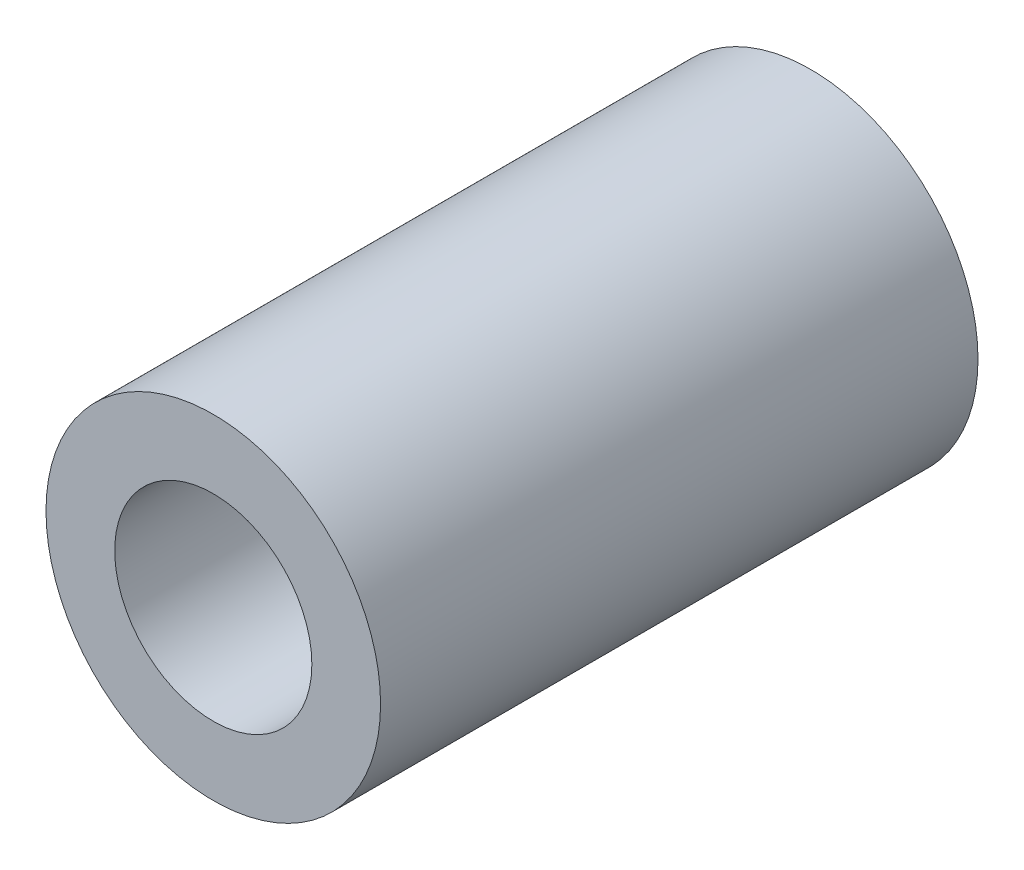
ISO-10303-21;
HEADER;
FILE_DESCRIPTION(('STEP AP214'),'2;1');
FILE_NAME('part.step','',(''),(''),'','','');
FILE_SCHEMA(('AUTOMOTIVE_DESIGN { 1 0 10303 214 1 1 1 1 }'));
ENDSEC;
DATA;
#1=APPLICATION_CONTEXT('core data for automotive mechanical design processes');
#2=APPLICATION_PROTOCOL_DEFINITION('international standard','automotive_design',2000,#1);
#3=PRODUCT_CONTEXT('',#1,'mechanical');
#4=PRODUCT('Part','Part','',(#3));
#5=PRODUCT_RELATED_PRODUCT_CATEGORY('part','',(#4));
#6=PRODUCT_DEFINITION_FORMATION('','',#4);
#7=PRODUCT_DEFINITION_CONTEXT('part definition',#1,'design');
#8=PRODUCT_DEFINITION('design','',#6,#7);
#9=PRODUCT_DEFINITION_SHAPE('','',#8);
#10=(LENGTH_UNIT() NAMED_UNIT(*) SI_UNIT(.MILLI.,.METRE.));
#11=(NAMED_UNIT(*) PLANE_ANGLE_UNIT() SI_UNIT($,.RADIAN.));
#12=(NAMED_UNIT(*) SI_UNIT($,.STERADIAN.) SOLID_ANGLE_UNIT());
#13=UNCERTAINTY_MEASURE_WITH_UNIT(LENGTH_MEASURE(1.E-05),#10,'distance_accuracy_value','');
#14=(GEOMETRIC_REPRESENTATION_CONTEXT(3) GLOBAL_UNCERTAINTY_ASSIGNED_CONTEXT((#13)) GLOBAL_UNIT_ASSIGNED_CONTEXT((#10,
#11,#12)) REPRESENTATION_CONTEXT('',''));
#15=CARTESIAN_POINT('',(0.,0.,0.));
#16=DIRECTION('',(0.,0.,1.));
#17=DIRECTION('',(1.,0.,0.));
#18=AXIS2_PLACEMENT_3D('',#15,#16,#17);
#19=CARTESIAN_POINT('',(0.,0.,10.));
#20=DIRECTION('',(0.,0.,-1.));
#21=DIRECTION('',(-1.,0.,0.));
#22=AXIS2_PLACEMENT_3D('',#19,#20,#21);
#23=CYLINDRICAL_SURFACE('',#22,2.8);
#24=CARTESIAN_POINT('',(0.,0.,10.));
#25=DIRECTION('',(0.,0.,1.));
#26=DIRECTION('',(1.,0.,0.));
#27=AXIS2_PLACEMENT_3D('',#24,#25,#26);
#28=CIRCLE('',#27,2.8);
#29=CARTESIAN_POINT('',(2.8,0.,10.));
#30=VERTEX_POINT('',#29);
#31=EDGE_CURVE('E10',#30,#30,#28,.T.);
#32=ORIENTED_EDGE('',*,*,#31,.F.);
#33=EDGE_LOOP('',(#32));
#34=FACE_BOUND('',#33,.T.);
#35=CARTESIAN_POINT('',(0.,0.,0.));
#36=DIRECTION('',(0.,0.,1.));
#37=DIRECTION('',(1.,0.,0.));
#38=AXIS2_PLACEMENT_3D('',#35,#36,#37);
#39=CIRCLE('',#38,2.8);
#40=CARTESIAN_POINT('',(2.8,0.,0.));
#41=VERTEX_POINT('',#40);
#42=EDGE_CURVE('E34',#41,#41,#39,.T.);
#43=ORIENTED_EDGE('',*,*,#42,.T.);
#44=EDGE_LOOP('',(#43));
#45=FACE_BOUND('',#44,.T.);
#46=ADVANCED_FACE('F31',(#34,#45),#23,.T.);
#47=CARTESIAN_POINT('',(0.,0.,10.));
#48=DIRECTION('',(0.,0.,1.));
#49=DIRECTION('',(1.,0.,0.));
#50=AXIS2_PLACEMENT_3D('',#47,#48,#49);
#51=PLANE('',#50);
#52=CARTESIAN_POINT('',(0.,0.,10.));
#53=DIRECTION('',(0.,0.,1.));
#54=DIRECTION('',(1.,0.,0.));
#55=AXIS2_PLACEMENT_3D('',#52,#53,#54);
#56=CIRCLE('',#55,1.65);
#57=CARTESIAN_POINT('',(1.65,0.,10.));
#58=VERTEX_POINT('',#57);
#59=EDGE_CURVE('E41',#58,#58,#56,.F.);
#60=ORIENTED_EDGE('',*,*,#59,.T.);
#61=EDGE_LOOP('',(#60));
#62=FACE_BOUND('',#61,.T.);
#63=ORIENTED_EDGE('',*,*,#31,.T.);
#64=EDGE_LOOP('',(#63));
#65=FACE_BOUND('',#64,.T.);
#66=ADVANCED_FACE('F59',(#62,#65),#51,.T.);
#67=CARTESIAN_POINT('',(0.,0.,0.));
#68=DIRECTION('',(0.,0.,1.));
#69=DIRECTION('',(1.,0.,0.));
#70=AXIS2_PLACEMENT_3D('',#67,#68,#69);
#71=PLANE('',#70);
#72=CARTESIAN_POINT('',(0.,0.,0.));
#73=DIRECTION('',(0.,0.,1.));
#74=DIRECTION('',(1.,0.,0.));
#75=AXIS2_PLACEMENT_3D('',#72,#73,#74);
#76=CIRCLE('',#75,1.65);
#77=CARTESIAN_POINT('',(1.65,0.,0.));
#78=VERTEX_POINT('',#77);
#79=EDGE_CURVE('E45',#78,#78,#76,.T.);
#80=ORIENTED_EDGE('',*,*,#79,.T.);
#81=EDGE_LOOP('',(#80));
#82=FACE_BOUND('',#81,.T.);
#83=ORIENTED_EDGE('',*,*,#42,.F.);
#84=EDGE_LOOP('',(#83));
#85=FACE_BOUND('',#84,.T.);
#86=ADVANCED_FACE('F49',(#82,#85),#71,.F.);
#87=CARTESIAN_POINT('',(0.,0.,10.8208336833532));
#88=DIRECTION('',(0.,0.,-1.));
#89=DIRECTION('',(-1.,0.,0.));
#90=AXIS2_PLACEMENT_3D('',#87,#88,#89);
#91=CYLINDRICAL_SURFACE('',#90,1.65);
#92=ORIENTED_EDGE('',*,*,#59,.F.);
#93=EDGE_LOOP('',(#92));
#94=FACE_BOUND('',#93,.T.);
#95=ORIENTED_EDGE('',*,*,#79,.F.);
#96=EDGE_LOOP('',(#95));
#97=FACE_BOUND('',#96,.T.);
#98=ADVANCED_FACE('F52',(#94,#97),#91,.F.);
#99=CLOSED_SHELL('',(#46,#66,#86,#98));
#100=MANIFOLD_SOLID_BREP('B2',#99);
#101=ADVANCED_BREP_SHAPE_REPRESENTATION('',(#18,#100),#14);
#102=SHAPE_DEFINITION_REPRESENTATION(#9,#101);
ENDSEC;
END-ISO-10303-21;
